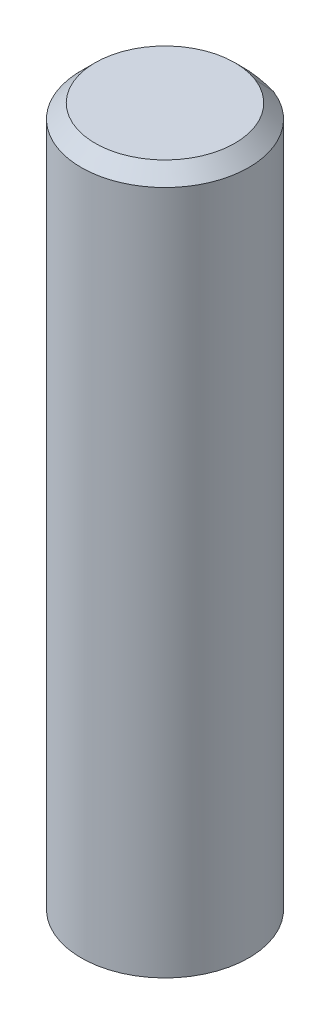
ISO-10303-21;
HEADER;
FILE_DESCRIPTION(('STEP AP214'),'2;1');
FILE_NAME('part.step','',(''),(''),'','','');
FILE_SCHEMA(('AUTOMOTIVE_DESIGN { 1 0 10303 214 1 1 1 1 }'));
ENDSEC;
DATA;
#1=APPLICATION_CONTEXT('core data for automotive mechanical design processes');
#2=APPLICATION_PROTOCOL_DEFINITION('international standard','automotive_design',2000,#1);
#3=PRODUCT_CONTEXT('',#1,'mechanical');
#4=PRODUCT('Part','Part','',(#3));
#5=PRODUCT_RELATED_PRODUCT_CATEGORY('part','',(#4));
#6=PRODUCT_DEFINITION_FORMATION('','',#4);
#7=PRODUCT_DEFINITION_CONTEXT('part definition',#1,'design');
#8=PRODUCT_DEFINITION('design','',#6,#7);
#9=PRODUCT_DEFINITION_SHAPE('','',#8);
#10=(LENGTH_UNIT() NAMED_UNIT(*) SI_UNIT(.MILLI.,.METRE.));
#11=(NAMED_UNIT(*) PLANE_ANGLE_UNIT() SI_UNIT($,.RADIAN.));
#12=(NAMED_UNIT(*) SI_UNIT($,.STERADIAN.) SOLID_ANGLE_UNIT());
#13=UNCERTAINTY_MEASURE_WITH_UNIT(LENGTH_MEASURE(1.E-05),#10,'distance_accuracy_value','');
#14=(GEOMETRIC_REPRESENTATION_CONTEXT(3) GLOBAL_UNCERTAINTY_ASSIGNED_CONTEXT((#13)) GLOBAL_UNIT_ASSIGNED_CONTEXT((#10,
#11,#12)) REPRESENTATION_CONTEXT('',''));
#15=CARTESIAN_POINT('',(0.,0.,0.));
#16=DIRECTION('',(0.,0.,1.));
#17=DIRECTION('',(1.,0.,0.));
#18=AXIS2_PLACEMENT_3D('',#15,#16,#17);
#19=CARTESIAN_POINT('',(0.,25.,0.));
#20=DIRECTION('',(0.,1.,0.));
#21=DIRECTION('',(0.,0.,1.));
#22=AXIS2_PLACEMENT_3D('',#19,#20,#21);
#23=PLANE('',#22);
#24=CARTESIAN_POINT('',(-4.41605694229922E-06,25.0000030573088,-2.31559280090398E-05));
#25=DIRECTION('',(0.,-1.,0.));
#26=DIRECTION('',(0.359014963110202,0.,-0.933331803949153));
#27=AXIS2_PLACEMENT_3D('',#24,#25,#26);
#28=CIRCLE('',#27,2.49999279933527);
#29=CARTESIAN_POINT('',(0.897528860195576,24.9999980865496,-2.33334181521173));
#30=VERTEX_POINT('',#29);
#31=CARTESIAN_POINT('',(-0.897543472307712,24.9999973786579,-2.33333651707424));
#32=VERTEX_POINT('',#31);
#33=EDGE_CURVE('E129',#30,#32,#28,.T.);
#34=ORIENTED_EDGE('',*,*,#33,.F.);
#35=CARTESIAN_POINT('',(3.96266032999439E-06,24.9999918798536,1.41741565208055E-06));
#36=DIRECTION('',(0.,-1.,0.));
#37=DIRECTION('',(-0.359017327837316,0.,-0.933330894330919));
#38=AXIS2_PLACEMENT_3D('',#35,#36,#37);
#39=CIRCLE('',#38,2.500005559707);
#40=EDGE_CURVE('E63',#32,#30,#39,.T.);
#41=ORIENTED_EDGE('',*,*,#40,.F.);
#42=EDGE_LOOP('',(#34,#41));
#43=FACE_BOUND('',#42,.T.);
#44=ADVANCED_FACE('F16',(#43),#23,.T.);
#45=CARTESIAN_POINT('',(3.96266032970383E-06,24.4970054045552,1.41741565208055E-06));
#46=DIRECTION('',(0.,-1.,0.));
#47=DIRECTION('',(1.,0.,0.));
#48=AXIS2_PLACEMENT_3D('',#45,#46,#47);
#49=CONICAL_SURFACE('',#48,3.00299594155375,0.785402046735676);
#50=ORIENTED_EDGE('',*,*,#40,.T.);
#51=CARTESIAN_POINT('',(1.0770315547767,24.5000172652965,-2.80000347708948));
#52=CARTESIAN_POINT('',(1.06955235910355,24.5208500066302,-2.78055940601546));
#53=CARTESIAN_POINT('',(1.06207316107593,24.5416827479638,-2.76111533584708));
#54=CARTESIAN_POINT('',(1.04711476031177,24.5833482306312,-2.72222719732165));
#55=CARTESIAN_POINT('',(1.03963555757523,24.6041809719649,-2.70278312896459));
#56=CARTESIAN_POINT('',(1.02467714739322,24.6458464546322,-2.66389499406179));
#57=CARTESIAN_POINT('',(1.01719793994775,24.6666791959659,-2.64445092751604));
#58=CARTESIAN_POINT('',(1.00223952034789,24.7083446786332,-2.60556279623587));
#59=CARTESIAN_POINT('',(0.994760308193491,24.7291774199669,-2.58611873150144));
#60=CARTESIAN_POINT('',(0.979801879175778,24.7708429026343,-2.54723060384389));
#61=CARTESIAN_POINT('',(0.972322662312459,24.7916756439679,-2.52778654092078));
#62=CARTESIAN_POINT('',(0.957364223876897,24.8333411266353,-2.48889841688587));
#63=CARTESIAN_POINT('',(0.949885002304653,24.854173867969,-2.46945435577407));
#64=CARTESIAN_POINT('',(0.934926554451241,24.8958393506363,-2.43056623536179));
#65=CARTESIAN_POINT('',(0.927447328170073,24.91667209197,-2.41112217606131));
#66=CARTESIAN_POINT('',(0.912488870898813,24.9583375746373,-2.37223405927167));
#67=CARTESIAN_POINT('',(0.905009639908721,24.979170315971,-2.35279000178251));
#68=CARTESIAN_POINT('',(0.897530406564166,25.0000030573047,-2.333345945199));
#69=B_SPLINE_CURVE_WITH_KNOTS('',3,(#51,#52,#53,#54,#55,#56,#57,#58,#59,#60,#61,#62,#63,#64,#65,
#66,#67,#68),.UNSPECIFIED.,.F.,.F.,(4,2,2,2,2,2,2,2,4),(0.,0.0883862003591188,0.176772400718206,
0.265158601077264,0.353544801436293,0.441931001795293,0.530317202154265,0.618703402513211,
0.707089602872129),.UNSPECIFIED.);
#70=CARTESIAN_POINT('',(1.07703017134735,24.5000122522552,-2.799999390986));
#71=VERTEX_POINT('',#70);
#72=EDGE_CURVE('E55',#71,#30,#69,.T.);
#73=ORIENTED_EDGE('',*,*,#72,.F.);
#74=CARTESIAN_POINT('',(-1.07702733909969,24.5000005957629,-2.8));
#75=CARTESIAN_POINT('',(-0.988360501257844,24.5318611098611,-2.8));
#76=CARTESIAN_POINT('',(-0.898499622788504,24.5606732561634,-2.8));
#77=CARTESIAN_POINT('',(-0.716573846856955,24.6110761875861,-2.8));
#78=CARTESIAN_POINT('',(-0.62450449335948,24.6326507749208,-2.8));
#79=CARTESIAN_POINT('',(-0.441821149886365,24.666727653097,-2.8));
#80=CARTESIAN_POINT('',(-0.351260023355029,24.6795068693926,-2.8));
#81=CARTESIAN_POINT('',(-0.169420516874613,24.6963353027654,-2.8));
#82=CARTESIAN_POINT('',(-0.0781430679434558,24.7003944144954,-2.8));
#83=CARTESIAN_POINT('',(0.102256575225958,24.6995507955354,-2.8));
#84=CARTESIAN_POINT('',(0.191379808211524,24.6948530920781,-2.8));
#85=CARTESIAN_POINT('',(0.368887378654103,24.6771876941868,-2.8));
#86=CARTESIAN_POINT('',(0.457270821855495,24.6642111420248,-2.8));
#87=CARTESIAN_POINT('',(0.635502246552053,24.6301639991567,-2.8));
#88=CARTESIAN_POINT('',(0.725300132633011,24.6088368711433,-2.8));
#89=CARTESIAN_POINT('',(0.902782417943566,24.5592986540397,-2.8));
#90=CARTESIAN_POINT('',(0.990470930973961,24.5311024030798,-2.8));
#91=CARTESIAN_POINT('',(1.07702704585084,24.5000035462817,-2.8));
#92=B_SPLINE_CURVE_WITH_KNOTS('',3,(#74,#75,#76,#77,#78,#79,#80,#81,#82,#83,#84,#85,#86,#87,#88,
#89,#90,#91),.UNSPECIFIED.,.F.,.F.,(4,2,2,2,2,2,2,2,4),(0.,0.282737183651158,0.56610298124071,
0.840079369403737,1.11374471355965,1.38108294082369,1.64870768010231,1.9252959942124,
2.20129206102959),.UNSPECIFIED.);
#93=CARTESIAN_POINT('',(-1.07703121602638,24.50001139474,-2.79999990336378));
#94=VERTEX_POINT('',#93);
#95=EDGE_CURVE('E61',#94,#71,#92,.T.);
#96=ORIENTED_EDGE('',*,*,#95,.F.);
#97=CARTESIAN_POINT('',(-0.897545725803441,25.0000040600753,-2.33334237544523));
#98=CARTESIAN_POINT('',(-0.90502450419262,24.9791712923816,-2.35278663527673));
#99=CARTESIAN_POINT('',(-0.912503267190457,24.9583385246881,-2.37223090102829));
#100=CARTESIAN_POINT('',(-0.927460762403527,24.9166729893011,-2.41111944437174));
#101=CARTESIAN_POINT('',(-0.93493949461876,24.8958402216076,-2.43056372196363));
#102=CARTESIAN_POINT('',(-0.949896928266607,24.8541746862205,-2.46945228898769));
#103=CARTESIAN_POINT('',(-0.957375629699221,24.833341918527,-2.48889657841987));
#104=CARTESIAN_POINT('',(-0.972333001781817,24.79167638314,-2.52778516912447));
#105=CARTESIAN_POINT('',(-0.979811672431798,24.7708436154465,-2.54722947039689));
#106=CARTESIAN_POINT('',(-0.994768982949113,24.7291780800594,-2.58611808478196));
#107=CARTESIAN_POINT('',(-1.00224762281645,24.7083453123659,-2.6055623978946));
#108=CARTESIAN_POINT('',(-1.01720487176845,24.6666797769789,-2.64445103596006));
#109=CARTESIAN_POINT('',(-1.02468348085313,24.6458470092854,-2.66389536091288));
#110=CARTESIAN_POINT('',(-1.0396406682398,24.6041814738983,-2.70278402265865));
#111=CARTESIAN_POINT('',(-1.0471192465418,24.5833487062048,-2.72222835945162));
#112=CARTESIAN_POINT('',(-1.0620763723631,24.5416831708178,-2.76111704487764));
#113=CARTESIAN_POINT('',(-1.06955491988241,24.5208504031242,-2.7805613935107));
#114=CARTESIAN_POINT('',(-1.07703345201031,24.5000176354309,-2.80000574806366));
#115=B_SPLINE_CURVE_WITH_KNOTS('',3,(#97,#98,#99,#100,#101,#102,#103,#104,#105,#106,#107,#108,
#109,#110,#111,#112,#113,#114),.UNSPECIFIED.,.F.,.F.,(4,2,2,2,2,2,2,2,4),(0.,0.0883863122168956,
0.176772624434927,0.26515893665412,0.353545248874506,0.441931561096109,0.530317873318958,
0.618704185543081,0.707090497768506),.UNSPECIFIED.);
#116=EDGE_CURVE('E68',#32,#94,#115,.T.);
#117=ORIENTED_EDGE('',*,*,#116,.F.);
#118=EDGE_LOOP('',(#50,#73,#96,#117));
#119=FACE_BOUND('',#118,.T.);
#120=ADVANCED_FACE('F58',(#119),#49,.T.);
#121=CARTESIAN_POINT('',(-4.41605694229922E-06,24.5000172653818,-2.31559280090398E-05));
#122=DIRECTION('',(0.,-1.,0.));
#123=DIRECTION('',(0.,0.,-1.));
#124=AXIS2_PLACEMENT_3D('',#121,#122,#123);
#125=CONICAL_SURFACE('',#124,2.99998271342511,0.785402285660375);
#126=CARTESIAN_POINT('',(1.07703073505263,24.5000200055549,-2.80000085638415));
#127=CARTESIAN_POINT('',(1.14639945044919,24.5000196974915,-2.77331846412729));
#128=CARTESIAN_POINT('',(1.21475231741991,24.500019371081,-2.74406535457629));
#129=CARTESIAN_POINT('',(1.34909168198969,24.5000186832593,-2.68057324593888));
#130=CARTESIAN_POINT('',(1.41507846309053,24.5000183218523,-2.64633484668899));
#131=CARTESIAN_POINT('',(1.60896574453586,24.5000171878311,-2.53639091083137));
#132=CARTESIAN_POINT('',(1.73284381843254,24.5000163651917,-2.45343711961753));
#133=CARTESIAN_POINT('',(1.98268578422548,24.5000144869511,-2.25774541449484));
#134=CARTESIAN_POINT('',(2.10668905785853,24.5000134148981,-2.1425021489527));
#135=CARTESIAN_POINT('',(2.33358896198295,24.5000111538008,-1.89283316629823));
#136=CARTESIAN_POINT('',(2.43648511113052,24.5000099647539,-1.75840701184242));
#137=CARTESIAN_POINT('',(2.61824366239636,24.5000075034855,-1.47419519476923));
#138=CARTESIAN_POINT('',(2.69710744574051,24.5000062312688,-1.32441041552841));
#139=CARTESIAN_POINT('',(2.82857614097165,24.5000036395988,-1.0137129558525));
#140=CARTESIAN_POINT('',(2.88117863184481,24.5000023201411,-0.852799251004332));
#141=CARTESIAN_POINT('',(2.9586197582734,24.4999996715865,-0.524427949855473));
#142=CARTESIAN_POINT('',(2.98345900348802,24.4999983424898,-0.35697049733395));
#143=CARTESIAN_POINT('',(3.00467002678918,24.4999957124236,-0.0202704294164454));
#144=CARTESIAN_POINT('',(3.00104317824884,24.4999944114526,0.148972099463444));
#145=CARTESIAN_POINT('',(2.96542796843656,24.4999918744807,0.484448815708189));
#146=CARTESIAN_POINT('',(2.9334391751144,24.4999906384807,0.650682957205568));
#147=CARTESIAN_POINT('',(2.84200670783689,24.4999882665364,0.975424312660123));
#148=CARTESIAN_POINT('',(2.78256254573618,24.4999871305939,1.13393138917781));
#149=CARTESIAN_POINT('',(2.63790710070614,24.4999849910422,1.43871487721766));
#150=CARTESIAN_POINT('',(2.55269597565034,24.4999839874322,1.58499136366932));
#151=CARTESIAN_POINT('',(2.35892592112377,24.4999821410315,1.86116161365626));
#152=CARTESIAN_POINT('',(2.2503671206833,24.49998129824,1.9910554677234));
#153=CARTESIAN_POINT('',(2.0129828454275,24.4999797973919,2.23077435670855));
#154=CARTESIAN_POINT('',(1.88415732993999,24.4999791393355,2.3405993513505));
#155=CARTESIAN_POINT('',(1.60989654615012,24.499978026639,2.53706274344243));
#156=CARTESIAN_POINT('',(1.46446125272486,24.4999775719991,2.62370110582113));
#157=CARTESIAN_POINT('',(1.16110964656593,24.4999768790427,2.77133155884341));
#158=CARTESIAN_POINT('',(1.00319334113525,24.499976640726,2.83232366449316));
#159=CARTESIAN_POINT('',(0.67936247318965,24.4999763871807,2.92693027431536));
#160=CARTESIAN_POINT('',(0.513447913413095,24.4999763719519,2.96054478786098));
#161=CARTESIAN_POINT('',(0.178330279415576,24.4999765650143,2.99944203527267));
#162=CARTESIAN_POINT('',(0.00912720456567936,24.4999767733056,3.0047247637202));
#163=CARTESIAN_POINT('',(-0.327764243844149,24.4999774074957,2.98680846552921));
#164=CARTESIAN_POINT('',(-0.495452617464928,24.4999778333944,2.96360944003484));
#165=CARTESIAN_POINT('',(-0.824554458917539,24.4999788907095,2.88938819522013));
#166=CARTESIAN_POINT('',(-0.985967927953037,24.4999795221258,2.83836598123692));
#167=CARTESIAN_POINT('',(-1.29793800877541,24.4999809725527,2.70994670571364));
#168=CARTESIAN_POINT('',(-1.44849461596084,24.4999817915633,2.63254963299527));
#169=CARTESIAN_POINT('',(-1.73447710801536,24.4999835939303,2.45357767610425));
#170=CARTESIAN_POINT('',(-1.86990298533246,24.4999845772868,2.35200277986416));
#171=CARTESIAN_POINT('',(-2.12177940312098,24.4999866804293,2.12755877342549));
#172=CARTESIAN_POINT('',(-2.2382299705752,24.4999878002153,2.00468969350765));
#173=CARTESIAN_POINT('',(-2.44885018571715,24.4999901444295,1.74114527462568));
#174=CARTESIAN_POINT('',(-2.54301986142572,24.4999913688576,1.60046995805532));
#175=CARTESIAN_POINT('',(-2.70640561277005,24.499993887605,1.30530570273905));
#176=CARTESIAN_POINT('',(-2.77562159015398,24.4999951819246,1.15081670960664));
#177=CARTESIAN_POINT('',(-2.88713469798363,24.499997803711,0.832410766291706));
#178=CARTESIAN_POINT('',(-2.92943177496895,24.499999131178,0.668493797386111));
#179=CARTESIAN_POINT('',(-2.98590590978311,24.5000017815633,0.335886646148389));
#180=CARTESIAN_POINT('',(-3.00008319001585,24.5000031044817,0.167196501578763));
#181=CARTESIAN_POINT('',(-2.99991607307604,24.5000057082311,-0.170170202700393));
#182=CARTESIAN_POINT('',(-2.98557157554522,24.500006989062,-0.338846762360034));
#183=CARTESIAN_POINT('',(-2.92876742623541,24.5000094722746,-0.671397847630818));
#184=CARTESIAN_POINT('',(-2.8863077499415,24.5000106746562,-0.835272369054713));
#185=CARTESIAN_POINT('',(-2.77448312927695,24.5000129667722,-1.15355809673407));
#186=CARTESIAN_POINT('',(-2.70511959601595,24.5000140565125,-1.30796979882343));
#187=CARTESIAN_POINT('',(-2.54144130495885,24.5000160926069,-1.6029748436524));
#188=CARTESIAN_POINT('',(-2.44712395250037,24.5000170389461,-1.74356674734299));
#189=CARTESIAN_POINT('',(-2.23620799602398,24.5000187614579,-2.00695346621601));
#190=CARTESIAN_POINT('',(-2.11960226299694,24.5000195375758,-2.12974256495704));
#191=CARTESIAN_POINT('',(-1.86744997043767,24.5000208969052,-2.35394058119845));
#192=CARTESIAN_POINT('',(-1.73191757796114,24.5000214802598,-2.45536534926887));
#193=CARTESIAN_POINT('',(-1.5078730305568,24.5000222304248,-2.5952815991631));
#194=CARTESIAN_POINT('',(-1.42439349548206,24.5000224682495,-2.64201369226755));
#195=CARTESIAN_POINT('',(-1.25350863628205,24.5000228745026,-2.72723580877453));
#196=CARTESIAN_POINT('',(-1.1661103465572,24.5000230430501,-2.76573993755593));
#197=CARTESIAN_POINT('',(-1.07703147338454,24.5000231763699,-2.80000057238193));
#198=B_SPLINE_CURVE_WITH_KNOTS('',3,(#126,#127,#128,#129,#130,#131,#132,#133,#134,#135,#136,
#137,#138,#139,#140,#141,#142,#143,#144,#145,#146,#147,#148,#149,#150,#151,#152,#153,#154,#155,
#156,#157,#158,#159,#160,#161,#162,#163,#164,#165,#166,#167,#168,#169,#170,#171,#172,#173,#174,
#175,#176,#177,#178,#179,#180,#181,#182,#183,#184,#185,#186,#187,#188,#189,#190,#191,#192,#193,
#194,#195,#196,#197),.UNSPECIFIED.,.F.,.F.,(4,2,2,2,2,2,2,2,2,2,2,2,2,2,2,2,2,2,2,2,2,2,2,2,2,2,
2,2,2,2,2,2,2,2,2,4),(0.,0.222868739289624,0.445710684848957,0.891233408253707,1.39668144036571,
1.90214099783921,2.40757149926559,2.91304858744602,3.41851457552618,3.92395617708004,
4.42940547838448,4.93486376671923,5.44031895818697,5.94577135634232,6.4512247688759,
6.95667894593649,7.4621328272445,7.96758653550186,8.47304034042881,8.97849412505115,
9.48394781271579,9.98940171460417,10.4948558687715,11.0003093041791,11.5057621039163,
12.0112168937844,12.5166726874726,13.0221244834153,13.5275780578713,14.033032073056,
14.538459580718,15.0439396626763,15.5495816954116,16.0548472517791,16.341465398886,
16.6275881767715),.UNSPECIFIED.);
#199=EDGE_CURVE('E72',#71,#94,#198,.T.);
#200=ORIENTED_EDGE('',*,*,#199,.F.);
#201=ORIENTED_EDGE('',*,*,#72,.T.);
#202=ORIENTED_EDGE('',*,*,#33,.T.);
#203=ORIENTED_EDGE('',*,*,#116,.T.);
#204=EDGE_LOOP('',(#200,#201,#202,#203));
#205=FACE_BOUND('',#204,.T.);
#206=ADVANCED_FACE('F73',(#205),#125,.T.);
#207=CARTESIAN_POINT('',(0.,0.,0.));
#208=DIRECTION('',(0.,1.,0.));
#209=DIRECTION('',(0.,0.,1.));
#210=AXIS2_PLACEMENT_3D('',#207,#208,#209);
#211=PLANE('',#210);
#212=DIRECTION('',(-1.,0.,0.));
#213=VECTOR('',#212,1.);
#214=CARTESIAN_POINT('',(1.0770329614269,0.,-2.8));
#215=LINE('',#214,#213);
#216=CARTESIAN_POINT('',(1.0770329614269,0.,-2.8));
#217=VERTEX_POINT('',#216);
#218=CARTESIAN_POINT('',(-1.07703221207887,0.,-2.80000028823996));
#219=VERTEX_POINT('',#218);
#220=EDGE_CURVE('E36',#217,#219,#215,.T.);
#221=ORIENTED_EDGE('',*,*,#220,.F.);
#222=CARTESIAN_POINT('',(0.,0.,0.));
#223=DIRECTION('',(0.,1.,0.));
#224=DIRECTION('',(0.,0.,1.));
#225=AXIS2_PLACEMENT_3D('',#222,#223,#224);
#226=CIRCLE('',#225,3.);
#227=EDGE_CURVE('E29',#219,#217,#226,.T.);
#228=ORIENTED_EDGE('',*,*,#227,.F.);
#229=EDGE_LOOP('',(#221,#228));
#230=FACE_BOUND('',#229,.T.);
#231=ADVANCED_FACE('F98',(#230),#211,.F.);
#232=CARTESIAN_POINT('',(1.0770329614269,0.,-2.8));
#233=DIRECTION('',(0.,0.,-1.));
#234=DIRECTION('',(-1.,0.,0.));
#235=AXIS2_PLACEMENT_3D('',#232,#233,#234);
#236=PLANE('',#235);
#237=ORIENTED_EDGE('',*,*,#220,.T.);
#238=DIRECTION('',(0.,1.,0.));
#239=VECTOR('',#238,1.);
#240=CARTESIAN_POINT('',(-1.07703146273084,0.,-2.80000057647992));
#241=LINE('',#240,#239);
#242=EDGE_CURVE('E77',#94,#219,#241,.F.);
#243=ORIENTED_EDGE('',*,*,#242,.F.);
#244=ORIENTED_EDGE('',*,*,#95,.T.);
#245=DIRECTION('',(0.,1.,0.));
#246=VECTOR('',#245,1.);
#247=CARTESIAN_POINT('',(1.0770329614269,0.,-2.8));
#248=LINE('',#247,#246);
#249=EDGE_CURVE('E11',#217,#71,#248,.T.);
#250=ORIENTED_EDGE('',*,*,#249,.F.);
#251=EDGE_LOOP('',(#237,#243,#244,#250));
#252=FACE_BOUND('',#251,.T.);
#253=ADVANCED_FACE('F79',(#252),#236,.T.);
#254=CARTESIAN_POINT('',(0.,0.,0.));
#255=DIRECTION('',(0.,1.,0.));
#256=DIRECTION('',(0.,0.,1.));
#257=AXIS2_PLACEMENT_3D('',#254,#255,#256);
#258=CYLINDRICAL_SURFACE('',#257,3.);
#259=ORIENTED_EDGE('',*,*,#227,.T.);
#260=ORIENTED_EDGE('',*,*,#249,.T.);
#261=ORIENTED_EDGE('',*,*,#199,.T.);
#262=ORIENTED_EDGE('',*,*,#242,.T.);
#263=EDGE_LOOP('',(#259,#260,#261,#262));
#264=FACE_BOUND('',#263,.T.);
#265=ADVANCED_FACE('F81',(#264),#258,.T.);
#266=CLOSED_SHELL('',(#44,#120,#206,#231,#253,#265));
#267=MANIFOLD_SOLID_BREP('B1',#266);
#268=ADVANCED_BREP_SHAPE_REPRESENTATION('',(#18,#267),#14);
#269=SHAPE_DEFINITION_REPRESENTATION(#9,#268);
ENDSEC;
END-ISO-10303-21;
